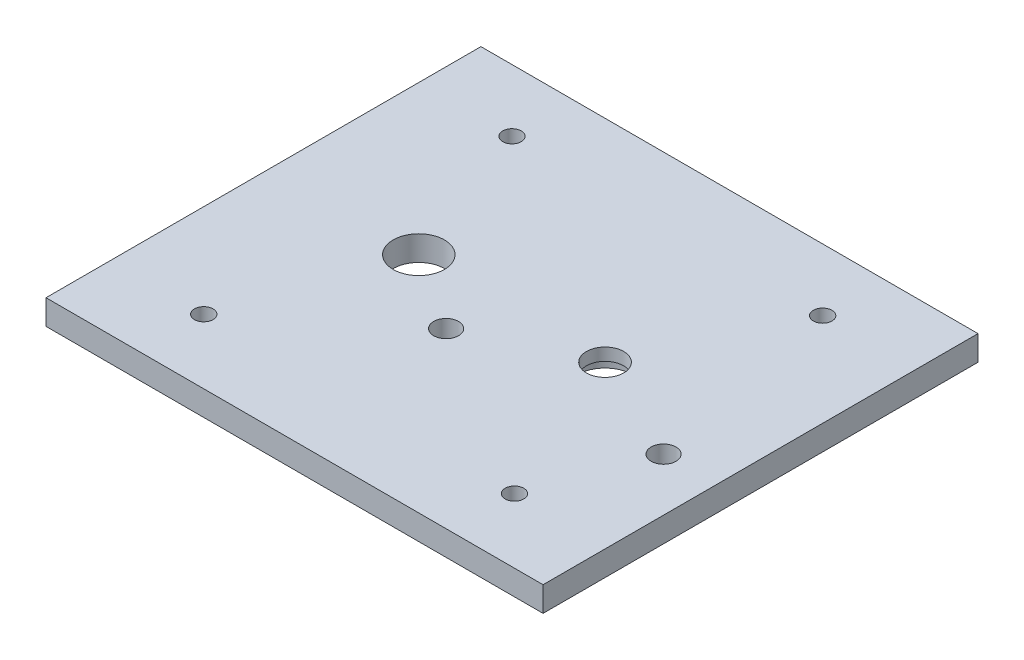
ISO-10303-21;
HEADER;
FILE_DESCRIPTION(('STEP AP214'),'2;1');
FILE_NAME('part.step','',(''),(''),'','','');
FILE_SCHEMA(('AUTOMOTIVE_DESIGN { 1 0 10303 214 1 1 1 1 }'));
ENDSEC;
DATA;
#1=APPLICATION_CONTEXT('core data for automotive mechanical design processes');
#2=APPLICATION_PROTOCOL_DEFINITION('international standard','automotive_design',2000,#1);
#3=PRODUCT_CONTEXT('',#1,'mechanical');
#4=PRODUCT('Part','Part','',(#3));
#5=PRODUCT_RELATED_PRODUCT_CATEGORY('part','',(#4));
#6=PRODUCT_DEFINITION_FORMATION('','',#4);
#7=PRODUCT_DEFINITION_CONTEXT('part definition',#1,'design');
#8=PRODUCT_DEFINITION('design','',#6,#7);
#9=PRODUCT_DEFINITION_SHAPE('','',#8);
#10=(LENGTH_UNIT() NAMED_UNIT(*) SI_UNIT(.MILLI.,.METRE.));
#11=(NAMED_UNIT(*) PLANE_ANGLE_UNIT() SI_UNIT($,.RADIAN.));
#12=(NAMED_UNIT(*) SI_UNIT($,.STERADIAN.) SOLID_ANGLE_UNIT());
#13=UNCERTAINTY_MEASURE_WITH_UNIT(LENGTH_MEASURE(1.E-05),#10,'distance_accuracy_value','');
#14=(GEOMETRIC_REPRESENTATION_CONTEXT(3) GLOBAL_UNCERTAINTY_ASSIGNED_CONTEXT((#13)) GLOBAL_UNIT_ASSIGNED_CONTEXT((#10,
#11,#12)) REPRESENTATION_CONTEXT('',''));
#15=CARTESIAN_POINT('',(0.,0.,0.));
#16=DIRECTION('',(0.,0.,1.));
#17=DIRECTION('',(1.,0.,0.));
#18=AXIS2_PLACEMENT_3D('',#15,#16,#17);
#19=CARTESIAN_POINT('',(40.,4.,0.));
#20=DIRECTION('',(1.,0.,0.));
#21=DIRECTION('',(0.,0.,-1.));
#22=AXIS2_PLACEMENT_3D('',#19,#20,#21);
#23=PLANE('',#22);
#24=DIRECTION('',(0.,0.,1.));
#25=VECTOR('',#24,1.);
#26=CARTESIAN_POINT('',(40.,0.,0.));
#27=LINE('',#26,#25);
#28=CARTESIAN_POINT('',(40.,0.,-35.));
#29=VERTEX_POINT('',#28);
#30=CARTESIAN_POINT('',(40.,0.,35.));
#31=VERTEX_POINT('',#30);
#32=EDGE_CURVE('E133',#29,#31,#27,.T.);
#33=ORIENTED_EDGE('',*,*,#32,.F.);
#34=DIRECTION('',(0.,-1.,0.));
#35=VECTOR('',#34,1.);
#36=CARTESIAN_POINT('',(40.,4.,-35.));
#37=LINE('',#36,#35);
#38=CARTESIAN_POINT('',(40.,4.,-35.));
#39=VERTEX_POINT('',#38);
#40=EDGE_CURVE('E11',#39,#29,#37,.T.);
#41=ORIENTED_EDGE('',*,*,#40,.F.);
#42=DIRECTION('',(0.,0.,1.));
#43=VECTOR('',#42,1.);
#44=CARTESIAN_POINT('',(40.,4.,0.));
#45=LINE('',#44,#43);
#46=CARTESIAN_POINT('',(40.,4.,35.));
#47=VERTEX_POINT('',#46);
#48=EDGE_CURVE('E102',#39,#47,#45,.T.);
#49=ORIENTED_EDGE('',*,*,#48,.T.);
#50=DIRECTION('',(0.,-1.,0.));
#51=VECTOR('',#50,1.);
#52=CARTESIAN_POINT('',(40.,4.,35.));
#53=LINE('',#52,#51);
#54=EDGE_CURVE('E79',#47,#31,#53,.T.);
#55=ORIENTED_EDGE('',*,*,#54,.T.);
#56=EDGE_LOOP('',(#33,#41,#49,#55));
#57=FACE_BOUND('',#56,.T.);
#58=ADVANCED_FACE('F38',(#57),#23,.T.);
#59=CARTESIAN_POINT('',(0.,4.,-35.));
#60=DIRECTION('',(0.,0.,-1.));
#61=DIRECTION('',(-1.,0.,0.));
#62=AXIS2_PLACEMENT_3D('',#59,#60,#61);
#63=PLANE('',#62);
#64=DIRECTION('',(1.,0.,0.));
#65=VECTOR('',#64,1.);
#66=CARTESIAN_POINT('',(0.,0.,-35.));
#67=LINE('',#66,#65);
#68=CARTESIAN_POINT('',(-40.,0.,-35.));
#69=VERTEX_POINT('',#68);
#70=EDGE_CURVE('E91',#69,#29,#67,.T.);
#71=ORIENTED_EDGE('',*,*,#70,.F.);
#72=DIRECTION('',(0.,-1.,0.));
#73=VECTOR('',#72,1.);
#74=CARTESIAN_POINT('',(-40.,4.,-35.));
#75=LINE('',#74,#73);
#76=CARTESIAN_POINT('',(-40.,4.,-35.));
#77=VERTEX_POINT('',#76);
#78=EDGE_CURVE('E48',#77,#69,#75,.T.);
#79=ORIENTED_EDGE('',*,*,#78,.F.);
#80=DIRECTION('',(1.,0.,0.));
#81=VECTOR('',#80,1.);
#82=CARTESIAN_POINT('',(0.,4.,-35.));
#83=LINE('',#82,#81);
#84=EDGE_CURVE('E89',#77,#39,#83,.T.);
#85=ORIENTED_EDGE('',*,*,#84,.T.);
#86=ORIENTED_EDGE('',*,*,#40,.T.);
#87=EDGE_LOOP('',(#71,#79,#85,#86));
#88=FACE_BOUND('',#87,.T.);
#89=ADVANCED_FACE('F87',(#88),#63,.T.);
#90=CARTESIAN_POINT('',(-40.,4.,0.));
#91=DIRECTION('',(1.,0.,0.));
#92=DIRECTION('',(0.,0.,-1.));
#93=AXIS2_PLACEMENT_3D('',#90,#91,#92);
#94=PLANE('',#93);
#95=DIRECTION('',(0.,0.,1.));
#96=VECTOR('',#95,1.);
#97=CARTESIAN_POINT('',(-40.,0.,0.));
#98=LINE('',#97,#96);
#99=CARTESIAN_POINT('',(-40.,0.,35.));
#100=VERTEX_POINT('',#99);
#101=EDGE_CURVE('E136',#69,#100,#98,.T.);
#102=ORIENTED_EDGE('',*,*,#101,.T.);
#103=DIRECTION('',(0.,-1.,0.));
#104=VECTOR('',#103,1.);
#105=CARTESIAN_POINT('',(-40.,4.,35.));
#106=LINE('',#105,#104);
#107=CARTESIAN_POINT('',(-40.,4.,35.));
#108=VERTEX_POINT('',#107);
#109=EDGE_CURVE('E94',#108,#100,#106,.T.);
#110=ORIENTED_EDGE('',*,*,#109,.F.);
#111=DIRECTION('',(0.,0.,1.));
#112=VECTOR('',#111,1.);
#113=CARTESIAN_POINT('',(-40.,4.,0.));
#114=LINE('',#113,#112);
#115=EDGE_CURVE('E97',#77,#108,#114,.T.);
#116=ORIENTED_EDGE('',*,*,#115,.F.);
#117=ORIENTED_EDGE('',*,*,#78,.T.);
#118=EDGE_LOOP('',(#102,#110,#116,#117));
#119=FACE_BOUND('',#118,.T.);
#120=ADVANCED_FACE('F98',(#119),#94,.F.);
#121=CARTESIAN_POINT('',(-3.49999999999998,4.,7.10266073478271));
#122=DIRECTION('',(0.,-1.,0.));
#123=DIRECTION('',(0.,0.,-1.));
#124=AXIS2_PLACEMENT_3D('',#121,#122,#123);
#125=CYLINDRICAL_SURFACE('',#124,2.);
#126=CARTESIAN_POINT('',(-3.49999999999998,4.,7.10266073478271));
#127=DIRECTION('',(0.,1.,0.));
#128=DIRECTION('',(0.,0.,1.));
#129=AXIS2_PLACEMENT_3D('',#126,#127,#128);
#130=CIRCLE('',#129,2.);
#131=CARTESIAN_POINT('',(-3.49999999999998,4.,9.10266073478271));
#132=VERTEX_POINT('',#131);
#133=EDGE_CURVE('E115',#132,#132,#130,.T.);
#134=ORIENTED_EDGE('',*,*,#133,.T.);
#135=EDGE_LOOP('',(#134));
#136=FACE_BOUND('',#135,.T.);
#137=CARTESIAN_POINT('',(-3.49999999999998,0.,7.10266073478271));
#138=DIRECTION('',(0.,1.,0.));
#139=DIRECTION('',(0.,0.,1.));
#140=AXIS2_PLACEMENT_3D('',#137,#138,#139);
#141=CIRCLE('',#140,2.);
#142=CARTESIAN_POINT('',(-3.49999999999998,0.,9.10266073478271));
#143=VERTEX_POINT('',#142);
#144=EDGE_CURVE('E145',#143,#143,#141,.T.);
#145=ORIENTED_EDGE('',*,*,#144,.F.);
#146=EDGE_LOOP('',(#145));
#147=FACE_BOUND('',#146,.T.);
#148=ADVANCED_FACE('F208',(#136,#147),#125,.F.);
#149=CARTESIAN_POINT('',(-16.,4.,-0.99999999999999));
#150=DIRECTION('',(0.,-1.,0.));
#151=DIRECTION('',(0.,0.,-1.));
#152=AXIS2_PLACEMENT_3D('',#149,#150,#151);
#153=CYLINDRICAL_SURFACE('',#152,4.125);
#154=CARTESIAN_POINT('',(-16.,4.,-0.99999999999999));
#155=DIRECTION('',(0.,1.,0.));
#156=DIRECTION('',(0.,0.,1.));
#157=AXIS2_PLACEMENT_3D('',#154,#155,#156);
#158=CIRCLE('',#157,4.125);
#159=CARTESIAN_POINT('',(-16.,4.,3.12500000000001));
#160=VERTEX_POINT('',#159);
#161=EDGE_CURVE('E112',#160,#160,#158,.T.);
#162=ORIENTED_EDGE('',*,*,#161,.T.);
#163=EDGE_LOOP('',(#162));
#164=FACE_BOUND('',#163,.T.);
#165=CARTESIAN_POINT('',(-16.,0.,-0.99999999999999));
#166=DIRECTION('',(0.,1.,0.));
#167=DIRECTION('',(0.,0.,1.));
#168=AXIS2_PLACEMENT_3D('',#165,#166,#167);
#169=CIRCLE('',#168,4.125);
#170=CARTESIAN_POINT('',(-16.,0.,3.12500000000001));
#171=VERTEX_POINT('',#170);
#172=EDGE_CURVE('E142',#171,#171,#169,.T.);
#173=ORIENTED_EDGE('',*,*,#172,.F.);
#174=EDGE_LOOP('',(#173));
#175=FACE_BOUND('',#174,.T.);
#176=ADVANCED_FACE('F211',(#164,#175),#153,.F.);
#177=CARTESIAN_POINT('',(-25.,4.,24.6066772895717));
#178=DIRECTION('',(0.,-1.,0.));
#179=DIRECTION('',(0.,0.,-1.));
#180=AXIS2_PLACEMENT_3D('',#177,#178,#179);
#181=CYLINDRICAL_SURFACE('',#180,1.5);
#182=CARTESIAN_POINT('',(-25.,4.,24.6066772895717));
#183=DIRECTION('',(0.,1.,0.));
#184=DIRECTION('',(0.,0.,1.));
#185=AXIS2_PLACEMENT_3D('',#182,#183,#184);
#186=CIRCLE('',#185,1.5);
#187=CARTESIAN_POINT('',(-25.,4.,26.1066772895717));
#188=VERTEX_POINT('',#187);
#189=EDGE_CURVE('E109',#188,#188,#186,.F.);
#190=ORIENTED_EDGE('',*,*,#189,.F.);
#191=EDGE_LOOP('',(#190));
#192=FACE_BOUND('',#191,.T.);
#193=CARTESIAN_POINT('',(-25.,0.,24.6066772895717));
#194=DIRECTION('',(0.,1.,0.));
#195=DIRECTION('',(0.,0.,1.));
#196=AXIS2_PLACEMENT_3D('',#193,#194,#195);
#197=CIRCLE('',#196,1.5);
#198=CARTESIAN_POINT('',(-25.,0.,26.1066772895717));
#199=VERTEX_POINT('',#198);
#200=EDGE_CURVE('E139',#199,#199,#197,.F.);
#201=ORIENTED_EDGE('',*,*,#200,.T.);
#202=EDGE_LOOP('',(#201));
#203=FACE_BOUND('',#202,.T.);
#204=ADVANCED_FACE('F215',(#192,#203),#181,.F.);
#205=CARTESIAN_POINT('',(0.,4.,35.));
#206=DIRECTION('',(0.,0.,-1.));
#207=DIRECTION('',(-1.,0.,0.));
#208=AXIS2_PLACEMENT_3D('',#205,#206,#207);
#209=PLANE('',#208);
#210=DIRECTION('',(1.,0.,0.));
#211=VECTOR('',#210,1.);
#212=CARTESIAN_POINT('',(0.,0.,35.));
#213=LINE('',#212,#211);
#214=EDGE_CURVE('E72',#100,#31,#213,.T.);
#215=ORIENTED_EDGE('',*,*,#214,.T.);
#216=ORIENTED_EDGE('',*,*,#54,.F.);
#217=DIRECTION('',(1.,0.,0.));
#218=VECTOR('',#217,1.);
#219=CARTESIAN_POINT('',(0.,4.,35.));
#220=LINE('',#219,#218);
#221=EDGE_CURVE('E56',#108,#47,#220,.T.);
#222=ORIENTED_EDGE('',*,*,#221,.F.);
#223=ORIENTED_EDGE('',*,*,#109,.T.);
#224=EDGE_LOOP('',(#215,#216,#222,#223));
#225=FACE_BOUND('',#224,.T.);
#226=ADVANCED_FACE('F151',(#225),#209,.F.);
#227=CARTESIAN_POINT('',(-25.,4.,-25.));
#228=DIRECTION('',(0.,-1.,0.));
#229=DIRECTION('',(0.,0.,-1.));
#230=AXIS2_PLACEMENT_3D('',#227,#228,#229);
#231=CYLINDRICAL_SURFACE('',#230,1.5);
#232=CARTESIAN_POINT('',(-25.,4.,-25.));
#233=DIRECTION('',(0.,1.,0.));
#234=DIRECTION('',(0.,0.,1.));
#235=AXIS2_PLACEMENT_3D('',#232,#233,#234);
#236=CIRCLE('',#235,1.5);
#237=CARTESIAN_POINT('',(-25.,4.,-23.5));
#238=VERTEX_POINT('',#237);
#239=EDGE_CURVE('E104',#238,#238,#236,.T.);
#240=ORIENTED_EDGE('',*,*,#239,.T.);
#241=EDGE_LOOP('',(#240));
#242=FACE_BOUND('',#241,.T.);
#243=CARTESIAN_POINT('',(-25.,0.,-25.));
#244=DIRECTION('',(0.,1.,0.));
#245=DIRECTION('',(0.,0.,1.));
#246=AXIS2_PLACEMENT_3D('',#243,#244,#245);
#247=CIRCLE('',#246,1.5);
#248=CARTESIAN_POINT('',(-25.,0.,-23.5));
#249=VERTEX_POINT('',#248);
#250=EDGE_CURVE('E130',#249,#249,#247,.T.);
#251=ORIENTED_EDGE('',*,*,#250,.F.);
#252=EDGE_LOOP('',(#251));
#253=FACE_BOUND('',#252,.T.);
#254=ADVANCED_FACE('F162',(#242,#253),#231,.F.);
#255=CARTESIAN_POINT('',(25.,4.,-25.));
#256=DIRECTION('',(0.,-1.,0.));
#257=DIRECTION('',(0.,0.,-1.));
#258=AXIS2_PLACEMENT_3D('',#255,#256,#257);
#259=CYLINDRICAL_SURFACE('',#258,1.5);
#260=CARTESIAN_POINT('',(25.,4.,-25.));
#261=DIRECTION('',(0.,1.,0.));
#262=DIRECTION('',(0.,0.,1.));
#263=AXIS2_PLACEMENT_3D('',#260,#261,#262);
#264=CIRCLE('',#263,1.5);
#265=CARTESIAN_POINT('',(25.,4.,-23.5));
#266=VERTEX_POINT('',#265);
#267=EDGE_CURVE('E312',#266,#266,#264,.T.);
#268=ORIENTED_EDGE('',*,*,#267,.T.);
#269=EDGE_LOOP('',(#268));
#270=FACE_BOUND('',#269,.T.);
#271=CARTESIAN_POINT('',(25.,0.,-25.));
#272=DIRECTION('',(0.,1.,0.));
#273=DIRECTION('',(0.,0.,1.));
#274=AXIS2_PLACEMENT_3D('',#271,#272,#273);
#275=CIRCLE('',#274,1.5);
#276=CARTESIAN_POINT('',(25.,0.,-23.5));
#277=VERTEX_POINT('',#276);
#278=EDGE_CURVE('E127',#277,#277,#275,.T.);
#279=ORIENTED_EDGE('',*,*,#278,.F.);
#280=EDGE_LOOP('',(#279));
#281=FACE_BOUND('',#280,.T.);
#282=ADVANCED_FACE('F165',(#270,#281),#259,.F.);
#283=CARTESIAN_POINT('',(25.,4.,24.6066772895717));
#284=DIRECTION('',(0.,-1.,0.));
#285=DIRECTION('',(0.,0.,-1.));
#286=AXIS2_PLACEMENT_3D('',#283,#284,#285);
#287=CYLINDRICAL_SURFACE('',#286,1.5);
#288=CARTESIAN_POINT('',(25.,4.,24.6066772895717));
#289=DIRECTION('',(0.,1.,0.));
#290=DIRECTION('',(0.,0.,1.));
#291=AXIS2_PLACEMENT_3D('',#288,#289,#290);
#292=CIRCLE('',#291,1.5);
#293=CARTESIAN_POINT('',(25.,4.,26.1066772895717));
#294=VERTEX_POINT('',#293);
#295=EDGE_CURVE('E180',#294,#294,#292,.F.);
#296=ORIENTED_EDGE('',*,*,#295,.F.);
#297=EDGE_LOOP('',(#296));
#298=FACE_BOUND('',#297,.T.);
#299=CARTESIAN_POINT('',(25.,0.,24.6066772895717));
#300=DIRECTION('',(0.,1.,0.));
#301=DIRECTION('',(0.,0.,1.));
#302=AXIS2_PLACEMENT_3D('',#299,#300,#301);
#303=CIRCLE('',#302,1.5);
#304=CARTESIAN_POINT('',(25.,0.,26.1066772895717));
#305=VERTEX_POINT('',#304);
#306=EDGE_CURVE('E124',#305,#305,#303,.F.);
#307=ORIENTED_EDGE('',*,*,#306,.T.);
#308=EDGE_LOOP('',(#307));
#309=FACE_BOUND('',#308,.T.);
#310=ADVANCED_FACE('F168',(#298,#309),#287,.F.);
#311=CARTESIAN_POINT('',(31.5,4.,7.10266073478268));
#312=DIRECTION('',(0.,-1.,0.));
#313=DIRECTION('',(0.,0.,-1.));
#314=AXIS2_PLACEMENT_3D('',#311,#312,#313);
#315=CYLINDRICAL_SURFACE('',#314,2.);
#316=CARTESIAN_POINT('',(31.5,4.,7.10266073478268));
#317=DIRECTION('',(0.,1.,0.));
#318=DIRECTION('',(0.,0.,1.));
#319=AXIS2_PLACEMENT_3D('',#316,#317,#318);
#320=CIRCLE('',#319,2.);
#321=CARTESIAN_POINT('',(31.5,4.,9.10266073478269));
#322=VERTEX_POINT('',#321);
#323=EDGE_CURVE('E148',#322,#322,#320,.T.);
#324=ORIENTED_EDGE('',*,*,#323,.T.);
#325=EDGE_LOOP('',(#324));
#326=FACE_BOUND('',#325,.T.);
#327=CARTESIAN_POINT('',(31.5,0.,7.10266073478268));
#328=DIRECTION('',(0.,1.,0.));
#329=DIRECTION('',(0.,0.,1.));
#330=AXIS2_PLACEMENT_3D('',#327,#328,#329);
#331=CIRCLE('',#330,2.);
#332=CARTESIAN_POINT('',(31.5,0.,9.10266073478269));
#333=VERTEX_POINT('',#332);
#334=EDGE_CURVE('E121',#333,#333,#331,.T.);
#335=ORIENTED_EDGE('',*,*,#334,.F.);
#336=EDGE_LOOP('',(#335));
#337=FACE_BOUND('',#336,.T.);
#338=ADVANCED_FACE('F40',(#326,#337),#315,.F.);
#339=CARTESIAN_POINT('',(13.9783394877401,4.,-0.999882702112453));
#340=DIRECTION('',(0.,-1.,0.));
#341=DIRECTION('',(0.,0.,-1.));
#342=AXIS2_PLACEMENT_3D('',#339,#340,#341);
#343=CYLINDRICAL_SURFACE('',#342,3.);
#344=CARTESIAN_POINT('',(13.9783394877401,2.,-0.999882702112453));
#345=DIRECTION('',(0.,1.,0.));
#346=DIRECTION('',(0.,0.,1.));
#347=AXIS2_PLACEMENT_3D('',#344,#345,#346);
#348=CIRCLE('',#347,3.);
#349=CARTESIAN_POINT('',(13.9783394877401,2.,2.00011729788754));
#350=VERTEX_POINT('',#349);
#351=EDGE_CURVE('E42',#350,#350,#348,.T.);
#352=ORIENTED_EDGE('',*,*,#351,.F.);
#353=EDGE_LOOP('',(#352));
#354=FACE_BOUND('',#353,.T.);
#355=CARTESIAN_POINT('',(13.9783394877401,4.,-0.999882702112453));
#356=DIRECTION('',(0.,1.,0.));
#357=DIRECTION('',(0.,0.,1.));
#358=AXIS2_PLACEMENT_3D('',#355,#356,#357);
#359=CIRCLE('',#358,3.);
#360=CARTESIAN_POINT('',(13.9783394877401,4.,2.00011729788754));
#361=VERTEX_POINT('',#360);
#362=EDGE_CURVE('E118',#361,#361,#359,.T.);
#363=ORIENTED_EDGE('',*,*,#362,.T.);
#364=EDGE_LOOP('',(#363));
#365=FACE_BOUND('',#364,.T.);
#366=ADVANCED_FACE('F175',(#354,#365),#343,.F.);
#367=CARTESIAN_POINT('',(0.,4.,0.));
#368=DIRECTION('',(0.,1.,0.));
#369=DIRECTION('',(0.,0.,1.));
#370=AXIS2_PLACEMENT_3D('',#367,#368,#369);
#371=PLANE('',#370);
#372=ORIENTED_EDGE('',*,*,#323,.F.);
#373=EDGE_LOOP('',(#372));
#374=FACE_BOUND('',#373,.T.);
#375=ORIENTED_EDGE('',*,*,#295,.T.);
#376=EDGE_LOOP('',(#375));
#377=FACE_BOUND('',#376,.T.);
#378=ORIENTED_EDGE('',*,*,#267,.F.);
#379=EDGE_LOOP('',(#378));
#380=FACE_BOUND('',#379,.T.);
#381=ORIENTED_EDGE('',*,*,#239,.F.);
#382=EDGE_LOOP('',(#381));
#383=FACE_BOUND('',#382,.T.);
#384=ORIENTED_EDGE('',*,*,#48,.F.);
#385=ORIENTED_EDGE('',*,*,#84,.F.);
#386=ORIENTED_EDGE('',*,*,#115,.T.);
#387=ORIENTED_EDGE('',*,*,#221,.T.);
#388=EDGE_LOOP('',(#384,#385,#386,#387));
#389=FACE_BOUND('',#388,.T.);
#390=ORIENTED_EDGE('',*,*,#189,.T.);
#391=EDGE_LOOP('',(#390));
#392=FACE_BOUND('',#391,.T.);
#393=ORIENTED_EDGE('',*,*,#161,.F.);
#394=EDGE_LOOP('',(#393));
#395=FACE_BOUND('',#394,.T.);
#396=ORIENTED_EDGE('',*,*,#133,.F.);
#397=EDGE_LOOP('',(#396));
#398=FACE_BOUND('',#397,.T.);
#399=ORIENTED_EDGE('',*,*,#362,.F.);
#400=EDGE_LOOP('',(#399));
#401=FACE_BOUND('',#400,.T.);
#402=ADVANCED_FACE('F100',(#374,#377,#380,#383,#389,#392,#395,#398,#401),#371,.T.);
#403=CARTESIAN_POINT('',(0.,0.,0.));
#404=DIRECTION('',(0.,1.,0.));
#405=DIRECTION('',(0.,0.,1.));
#406=AXIS2_PLACEMENT_3D('',#403,#404,#405);
#407=PLANE('',#406);
#408=CARTESIAN_POINT('',(13.9783394877401,0.,-0.999882702112453));
#409=DIRECTION('',(0.,1.,0.));
#410=DIRECTION('',(0.,0.,1.));
#411=AXIS2_PLACEMENT_3D('',#408,#409,#410);
#412=CIRCLE('',#411,4.5);
#413=CARTESIAN_POINT('',(13.9783394877401,0.,3.50011729788755));
#414=VERTEX_POINT('',#413);
#415=EDGE_CURVE('E305',#414,#414,#412,.T.);
#416=ORIENTED_EDGE('',*,*,#415,.T.);
#417=EDGE_LOOP('',(#416));
#418=FACE_BOUND('',#417,.T.);
#419=ORIENTED_EDGE('',*,*,#334,.T.);
#420=EDGE_LOOP('',(#419));
#421=FACE_BOUND('',#420,.T.);
#422=ORIENTED_EDGE('',*,*,#306,.F.);
#423=EDGE_LOOP('',(#422));
#424=FACE_BOUND('',#423,.T.);
#425=ORIENTED_EDGE('',*,*,#278,.T.);
#426=EDGE_LOOP('',(#425));
#427=FACE_BOUND('',#426,.T.);
#428=ORIENTED_EDGE('',*,*,#250,.T.);
#429=EDGE_LOOP('',(#428));
#430=FACE_BOUND('',#429,.T.);
#431=ORIENTED_EDGE('',*,*,#32,.T.);
#432=ORIENTED_EDGE('',*,*,#214,.F.);
#433=ORIENTED_EDGE('',*,*,#101,.F.);
#434=ORIENTED_EDGE('',*,*,#70,.T.);
#435=EDGE_LOOP('',(#431,#432,#433,#434));
#436=FACE_BOUND('',#435,.T.);
#437=ORIENTED_EDGE('',*,*,#200,.F.);
#438=EDGE_LOOP('',(#437));
#439=FACE_BOUND('',#438,.T.);
#440=ORIENTED_EDGE('',*,*,#172,.T.);
#441=EDGE_LOOP('',(#440));
#442=FACE_BOUND('',#441,.T.);
#443=ORIENTED_EDGE('',*,*,#144,.T.);
#444=EDGE_LOOP('',(#443));
#445=FACE_BOUND('',#444,.T.);
#446=ADVANCED_FACE('F152',(#418,#421,#424,#427,#430,#436,#439,#442,#445),#407,.F.);
#447=CARTESIAN_POINT('',(13.9783394877401,2.,-0.999882702112453));
#448=DIRECTION('',(0.,-1.,0.));
#449=DIRECTION('',(0.,0.,-1.));
#450=AXIS2_PLACEMENT_3D('',#447,#448,#449);
#451=CYLINDRICAL_SURFACE('',#450,4.5);
#452=CARTESIAN_POINT('',(13.9783394877401,2.,-0.999882702112453));
#453=DIRECTION('',(0.,1.,0.));
#454=DIRECTION('',(0.,0.,1.));
#455=AXIS2_PLACEMENT_3D('',#452,#453,#454);
#456=CIRCLE('',#455,4.5);
#457=CARTESIAN_POINT('',(13.9783394877401,2.,3.50011729788755));
#458=VERTEX_POINT('',#457);
#459=EDGE_CURVE('E304',#458,#458,#456,.T.);
#460=ORIENTED_EDGE('',*,*,#459,.T.);
#461=EDGE_LOOP('',(#460));
#462=FACE_BOUND('',#461,.T.);
#463=ORIENTED_EDGE('',*,*,#415,.F.);
#464=EDGE_LOOP('',(#463));
#465=FACE_BOUND('',#464,.T.);
#466=ADVANCED_FACE('F185',(#462,#465),#451,.F.);
#467=CARTESIAN_POINT('',(13.9783394877401,2.,-0.999882702112453));
#468=DIRECTION('',(0.,1.,0.));
#469=DIRECTION('',(0.,0.,1.));
#470=AXIS2_PLACEMENT_3D('',#467,#468,#469);
#471=PLANE('',#470);
#472=ORIENTED_EDGE('',*,*,#351,.T.);
#473=EDGE_LOOP('',(#472));
#474=FACE_BOUND('',#473,.T.);
#475=ORIENTED_EDGE('',*,*,#459,.F.);
#476=EDGE_LOOP('',(#475));
#477=FACE_BOUND('',#476,.T.);
#478=ADVANCED_FACE('F197',(#474,#477),#471,.F.);
#479=CLOSED_SHELL('',(#58,#89,#120,#148,#176,#204,#226,#254,#282,#310,#338,#366,#402,#446,#466,#478));
#480=MANIFOLD_SOLID_BREP('B2',#479);
#481=ADVANCED_BREP_SHAPE_REPRESENTATION('',(#18,#480),#14);
#482=SHAPE_DEFINITION_REPRESENTATION(#9,#481);
ENDSEC;
END-ISO-10303-21;
